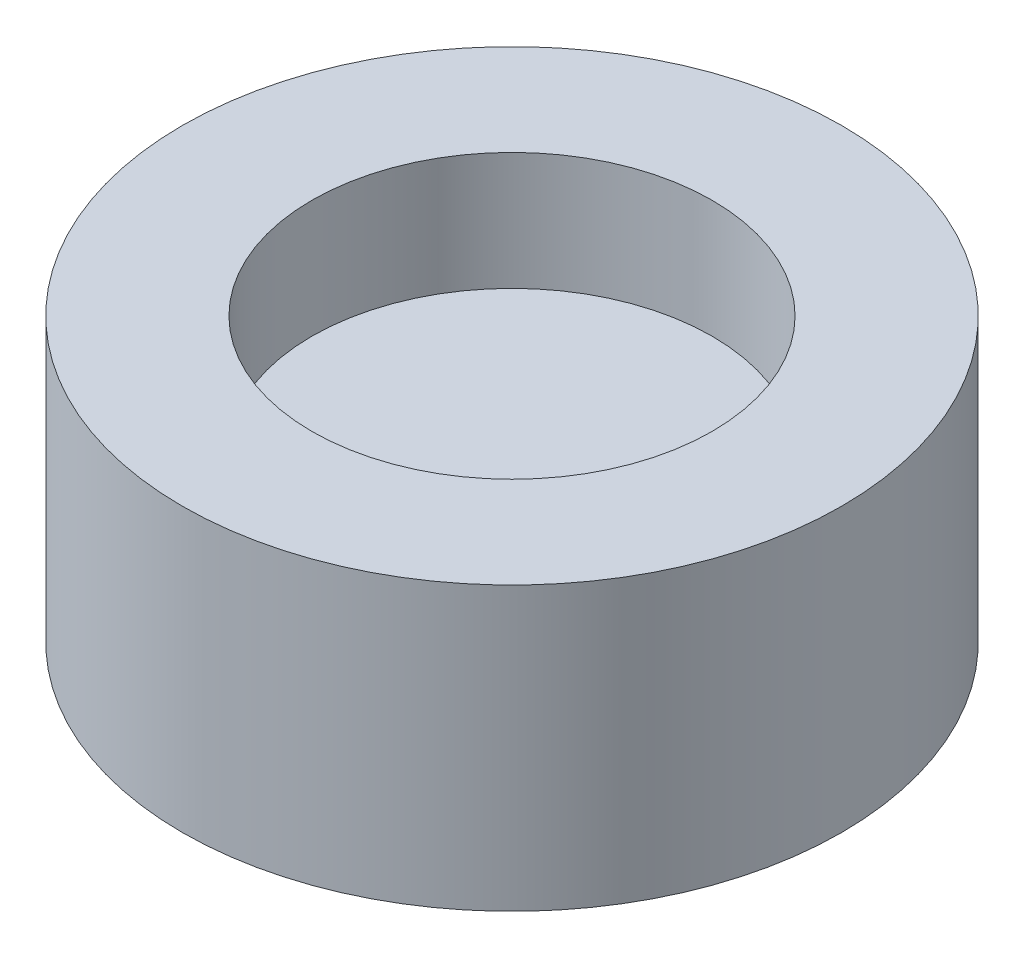
ISO-10303-21;
HEADER;
FILE_DESCRIPTION(('STEP AP214'),'2;1');
FILE_NAME('part.step','',(''),(''),'','','');
FILE_SCHEMA(('AUTOMOTIVE_DESIGN { 1 0 10303 214 1 1 1 1 }'));
ENDSEC;
DATA;
#1=APPLICATION_CONTEXT('core data for automotive mechanical design processes');
#2=APPLICATION_PROTOCOL_DEFINITION('international standard','automotive_design',2000,#1);
#3=PRODUCT_CONTEXT('',#1,'mechanical');
#4=PRODUCT('Part','Part','',(#3));
#5=PRODUCT_RELATED_PRODUCT_CATEGORY('part','',(#4));
#6=PRODUCT_DEFINITION_FORMATION('','',#4);
#7=PRODUCT_DEFINITION_CONTEXT('part definition',#1,'design');
#8=PRODUCT_DEFINITION('design','',#6,#7);
#9=PRODUCT_DEFINITION_SHAPE('','',#8);
#10=(LENGTH_UNIT() NAMED_UNIT(*) SI_UNIT(.MILLI.,.METRE.));
#11=(NAMED_UNIT(*) PLANE_ANGLE_UNIT() SI_UNIT($,.RADIAN.));
#12=(NAMED_UNIT(*) SI_UNIT($,.STERADIAN.) SOLID_ANGLE_UNIT());
#13=UNCERTAINTY_MEASURE_WITH_UNIT(LENGTH_MEASURE(1.E-05),#10,'distance_accuracy_value','');
#14=(GEOMETRIC_REPRESENTATION_CONTEXT(3) GLOBAL_UNCERTAINTY_ASSIGNED_CONTEXT((#13)) GLOBAL_UNIT_ASSIGNED_CONTEXT((#10,
#11,#12)) REPRESENTATION_CONTEXT('',''));
#15=CARTESIAN_POINT('',(0.,0.,0.));
#16=DIRECTION('',(0.,0.,1.));
#17=DIRECTION('',(1.,0.,0.));
#18=AXIS2_PLACEMENT_3D('',#15,#16,#17);
#19=CARTESIAN_POINT('',(0.,0.,0.));
#20=DIRECTION('',(0.,1.,0.));
#21=DIRECTION('',(0.,0.,1.));
#22=AXIS2_PLACEMENT_3D('',#19,#20,#21);
#23=PLANE('',#22);
#24=CARTESIAN_POINT('',(0.,0.,0.));
#25=DIRECTION('',(0.,1.,0.));
#26=DIRECTION('',(0.,0.,1.));
#27=AXIS2_PLACEMENT_3D('',#24,#25,#26);
#28=CIRCLE('',#27,7.);
#29=CARTESIAN_POINT('',(0.,0.,7.));
#30=VERTEX_POINT('',#29);
#31=EDGE_CURVE('E42',#30,#30,#28,.T.);
#32=ORIENTED_EDGE('',*,*,#31,.F.);
#33=EDGE_LOOP('',(#32));
#34=FACE_BOUND('',#33,.T.);
#35=CARTESIAN_POINT('',(0.,0.,0.));
#36=DIRECTION('',(0.,1.,0.));
#37=DIRECTION('',(0.,0.,1.));
#38=AXIS2_PLACEMENT_3D('',#35,#36,#37);
#39=CIRCLE('',#38,5.25);
#40=CARTESIAN_POINT('',(0.,0.,5.25));
#41=VERTEX_POINT('',#40);
#42=EDGE_CURVE('E46',#41,#41,#39,.T.);
#43=ORIENTED_EDGE('',*,*,#42,.T.);
#44=EDGE_LOOP('',(#43));
#45=FACE_BOUND('',#44,.T.);
#46=ADVANCED_FACE('F35',(#34,#45),#23,.F.);
#47=CARTESIAN_POINT('',(0.,2.5,0.));
#48=DIRECTION('',(0.,-1.,0.));
#49=DIRECTION('',(0.,0.,-1.));
#50=AXIS2_PLACEMENT_3D('',#47,#48,#49);
#51=CYLINDRICAL_SURFACE('',#50,7.);
#52=ORIENTED_EDGE('',*,*,#31,.T.);
#53=EDGE_LOOP('',(#52));
#54=FACE_BOUND('',#53,.T.);
#55=CARTESIAN_POINT('',(0.,6.,0.));
#56=DIRECTION('',(0.,1.,0.));
#57=DIRECTION('',(0.,0.,1.));
#58=AXIS2_PLACEMENT_3D('',#55,#56,#57);
#59=CIRCLE('',#58,7.);
#60=CARTESIAN_POINT('',(0.,6.,7.));
#61=VERTEX_POINT('',#60);
#62=EDGE_CURVE('E55',#61,#61,#59,.T.);
#63=ORIENTED_EDGE('',*,*,#62,.F.);
#64=EDGE_LOOP('',(#63));
#65=FACE_BOUND('',#64,.T.);
#66=ADVANCED_FACE('F37',(#54,#65),#51,.T.);
#67=CARTESIAN_POINT('',(0.,2.5,0.));
#68=DIRECTION('',(0.,-1.,0.));
#69=DIRECTION('',(0.,0.,-1.));
#70=AXIS2_PLACEMENT_3D('',#67,#68,#69);
#71=CYLINDRICAL_SURFACE('',#70,5.25);
#72=CARTESIAN_POINT('',(0.,2.5,0.));
#73=DIRECTION('',(0.,1.,0.));
#74=DIRECTION('',(0.,0.,1.));
#75=AXIS2_PLACEMENT_3D('',#72,#73,#74);
#76=CIRCLE('',#75,5.25);
#77=CARTESIAN_POINT('',(0.,2.5,5.25));
#78=VERTEX_POINT('',#77);
#79=EDGE_CURVE('E50',#78,#78,#76,.T.);
#80=ORIENTED_EDGE('',*,*,#79,.T.);
#81=EDGE_LOOP('',(#80));
#82=FACE_BOUND('',#81,.T.);
#83=ORIENTED_EDGE('',*,*,#42,.F.);
#84=EDGE_LOOP('',(#83));
#85=FACE_BOUND('',#84,.T.);
#86=ADVANCED_FACE('F75',(#82,#85),#71,.F.);
#87=CARTESIAN_POINT('',(0.,2.5,0.));
#88=DIRECTION('',(0.,1.,0.));
#89=DIRECTION('',(0.,0.,1.));
#90=AXIS2_PLACEMENT_3D('',#87,#88,#89);
#91=PLANE('',#90);
#92=ORIENTED_EDGE('',*,*,#79,.F.);
#93=EDGE_LOOP('',(#92));
#94=FACE_BOUND('',#93,.T.);
#95=ADVANCED_FACE('F66',(#94),#91,.F.);
#96=CARTESIAN_POINT('',(0.,6.,0.));
#97=DIRECTION('',(0.,1.,0.));
#98=DIRECTION('',(0.,0.,1.));
#99=AXIS2_PLACEMENT_3D('',#96,#97,#98);
#100=PLANE('',#99);
#101=ORIENTED_EDGE('',*,*,#62,.T.);
#102=EDGE_LOOP('',(#101));
#103=FACE_BOUND('',#102,.T.);
#104=CARTESIAN_POINT('',(0.,6.,0.));
#105=DIRECTION('',(0.,1.,0.));
#106=DIRECTION('',(0.,0.,1.));
#107=AXIS2_PLACEMENT_3D('',#104,#105,#106);
#108=CIRCLE('',#107,4.25);
#109=CARTESIAN_POINT('',(0.,6.,4.25));
#110=VERTEX_POINT('',#109);
#111=EDGE_CURVE('E58',#110,#110,#108,.T.);
#112=ORIENTED_EDGE('',*,*,#111,.F.);
#113=EDGE_LOOP('',(#112));
#114=FACE_BOUND('',#113,.T.);
#115=ADVANCED_FACE('F64',(#103,#114),#100,.T.);
#116=CARTESIAN_POINT('',(0.,6.,0.));
#117=DIRECTION('',(0.,-1.,0.));
#118=DIRECTION('',(0.,0.,-1.));
#119=AXIS2_PLACEMENT_3D('',#116,#117,#118);
#120=CYLINDRICAL_SURFACE('',#119,4.25);
#121=ORIENTED_EDGE('',*,*,#111,.T.);
#122=EDGE_LOOP('',(#121));
#123=FACE_BOUND('',#122,.T.);
#124=CARTESIAN_POINT('',(0.,3.5,0.));
#125=DIRECTION('',(0.,1.,0.));
#126=DIRECTION('',(0.,0.,1.));
#127=AXIS2_PLACEMENT_3D('',#124,#125,#126);
#128=CIRCLE('',#127,4.25);
#129=CARTESIAN_POINT('',(0.,3.5,4.25));
#130=VERTEX_POINT('',#129);
#131=EDGE_CURVE('E10',#130,#130,#128,.F.);
#132=ORIENTED_EDGE('',*,*,#131,.T.);
#133=EDGE_LOOP('',(#132));
#134=FACE_BOUND('',#133,.T.);
#135=ADVANCED_FACE('F62',(#123,#134),#120,.F.);
#136=CARTESIAN_POINT('',(0.,3.5,0.));
#137=DIRECTION('',(0.,1.,0.));
#138=DIRECTION('',(0.,0.,1.));
#139=AXIS2_PLACEMENT_3D('',#136,#137,#138);
#140=PLANE('',#139);
#141=ORIENTED_EDGE('',*,*,#131,.F.);
#142=EDGE_LOOP('',(#141));
#143=FACE_BOUND('',#142,.T.);
#144=ADVANCED_FACE('F73',(#143),#140,.T.);
#145=CLOSED_SHELL('',(#46,#66,#86,#95,#115,#135,#144));
#146=MANIFOLD_SOLID_BREP('B2',#145);
#147=ADVANCED_BREP_SHAPE_REPRESENTATION('',(#18,#146),#14);
#148=SHAPE_DEFINITION_REPRESENTATION(#9,#147);
ENDSEC;
END-ISO-10303-21;
